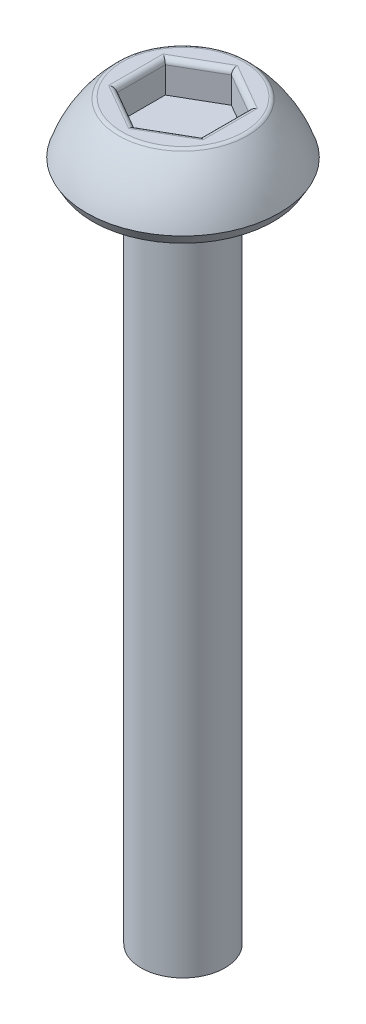
ISO-10303-21;
HEADER;
FILE_DESCRIPTION(('STEP AP214'),'2;1');
FILE_NAME('part.step','',(''),(''),'','','');
FILE_SCHEMA(('AUTOMOTIVE_DESIGN { 1 0 10303 214 1 1 1 1 }'));
ENDSEC;
DATA;
#1=APPLICATION_CONTEXT('core data for automotive mechanical design processes');
#2=APPLICATION_PROTOCOL_DEFINITION('international standard','automotive_design',2000,#1);
#3=PRODUCT_CONTEXT('',#1,'mechanical');
#4=PRODUCT('Part','Part','',(#3));
#5=PRODUCT_RELATED_PRODUCT_CATEGORY('part','',(#4));
#6=PRODUCT_DEFINITION_FORMATION('','',#4);
#7=PRODUCT_DEFINITION_CONTEXT('part definition',#1,'design');
#8=PRODUCT_DEFINITION('design','',#6,#7);
#9=PRODUCT_DEFINITION_SHAPE('','',#8);
#10=(LENGTH_UNIT() NAMED_UNIT(*) SI_UNIT(.MILLI.,.METRE.));
#11=(NAMED_UNIT(*) PLANE_ANGLE_UNIT() SI_UNIT($,.RADIAN.));
#12=(NAMED_UNIT(*) SI_UNIT($,.STERADIAN.) SOLID_ANGLE_UNIT());
#13=UNCERTAINTY_MEASURE_WITH_UNIT(LENGTH_MEASURE(1.E-05),#10,'distance_accuracy_value','');
#14=(GEOMETRIC_REPRESENTATION_CONTEXT(3) GLOBAL_UNCERTAINTY_ASSIGNED_CONTEXT((#13)) GLOBAL_UNIT_ASSIGNED_CONTEXT((#10,
#11,#12)) REPRESENTATION_CONTEXT('',''));
#15=CARTESIAN_POINT('',(0.,0.,0.));
#16=DIRECTION('',(0.,0.,1.));
#17=DIRECTION('',(1.,0.,0.));
#18=AXIS2_PLACEMENT_3D('',#15,#16,#17);
#19=CARTESIAN_POINT('',(0.,1.5,0.));
#20=DIRECTION('',(0.,-1.,0.));
#21=DIRECTION('',(0.,0.,-1.));
#22=AXIS2_PLACEMENT_3D('',#19,#20,#21);
#23=PLANE('',#22);
#24=CARTESIAN_POINT('',(0.,1.5,0.));
#25=DIRECTION('',(0.,-1.,0.));
#26=DIRECTION('',(0.,0.,-1.));
#27=AXIS2_PLACEMENT_3D('',#24,#25,#26);
#28=CIRCLE('',#27,1.45007695941143);
#29=CARTESIAN_POINT('',(0.,1.5,-1.45007695941143));
#30=VERTEX_POINT('',#29);
#31=EDGE_CURVE('E178',#30,#30,#28,.F.);
#32=ORIENTED_EDGE('',*,*,#31,.T.);
#33=EDGE_LOOP('',(#32));
#34=FACE_BOUND('',#33,.T.);
#35=DIRECTION('',(0.866025403784439,0.,-0.5));
#36=VECTOR('',#35,1.);
#37=CARTESIAN_POINT('',(0.5625,1.5,0.974278579257493));
#38=LINE('',#37,#36);
#39=CARTESIAN_POINT('',(1.125,1.5,0.649519052838329));
#40=VERTEX_POINT('',#39);
#41=CARTESIAN_POINT('',(0.,1.5,1.29903810567666));
#42=VERTEX_POINT('',#41);
#43=EDGE_CURVE('E173',#40,#42,#38,.F.);
#44=ORIENTED_EDGE('',*,*,#43,.T.);
#45=DIRECTION('',(0.866025403784439,0.,0.5));
#46=VECTOR('',#45,1.);
#47=CARTESIAN_POINT('',(-0.5625,1.5,0.974278579257493));
#48=LINE('',#47,#46);
#49=CARTESIAN_POINT('',(-1.125,1.5,0.649519052838329));
#50=VERTEX_POINT('',#49);
#51=EDGE_CURVE('E175',#42,#50,#48,.F.);
#52=ORIENTED_EDGE('',*,*,#51,.T.);
#53=DIRECTION('',(0.,0.,1.));
#54=VECTOR('',#53,1.);
#55=CARTESIAN_POINT('',(-1.125,1.5,0.));
#56=LINE('',#55,#54);
#57=CARTESIAN_POINT('',(-1.125,1.5,-0.649519052838329));
#58=VERTEX_POINT('',#57);
#59=EDGE_CURVE('E165',#50,#58,#56,.F.);
#60=ORIENTED_EDGE('',*,*,#59,.T.);
#61=DIRECTION('',(-0.866025403784439,0.,0.5));
#62=VECTOR('',#61,1.);
#63=CARTESIAN_POINT('',(-0.5625,1.5,-0.974278579257493));
#64=LINE('',#63,#62);
#65=CARTESIAN_POINT('',(0.,1.5,-1.29903810567666));
#66=VERTEX_POINT('',#65);
#67=EDGE_CURVE('E167',#58,#66,#64,.F.);
#68=ORIENTED_EDGE('',*,*,#67,.T.);
#69=DIRECTION('',(-0.866025403784439,0.,-0.5));
#70=VECTOR('',#69,1.);
#71=CARTESIAN_POINT('',(0.5625,1.5,-0.974278579257494));
#72=LINE('',#71,#70);
#73=CARTESIAN_POINT('',(1.125,1.5,-0.64951905283833));
#74=VERTEX_POINT('',#73);
#75=EDGE_CURVE('E169',#66,#74,#72,.F.);
#76=ORIENTED_EDGE('',*,*,#75,.T.);
#77=DIRECTION('',(0.,0.,-1.));
#78=VECTOR('',#77,1.);
#79=CARTESIAN_POINT('',(1.125,1.5,0.));
#80=LINE('',#79,#78);
#81=EDGE_CURVE('E171',#74,#40,#80,.F.);
#82=ORIENTED_EDGE('',*,*,#81,.T.);
#83=EDGE_LOOP('',(#44,#52,#60,#68,#76,#82));
#84=FACE_BOUND('',#83,.T.);
#85=ADVANCED_FACE('F36',(#34,#84),#23,.F.);
#86=CARTESIAN_POINT('',(0.,-0.691910970237067,0.));
#87=DIRECTION('',(0.,-1.,0.));
#88=DIRECTION('',(0.,0.,-1.));
#89=AXIS2_PLACEMENT_3D('',#86,#87,#88);
#90=DEGENERATE_TOROIDAL_SURFACE('',#89,0.548298390995416,3.,.F.);
#91=CARTESIAN_POINT('',(0.,1.46486569435813,0.));
#92=DIRECTION('',(0.,-1.,0.));
#93=DIRECTION('',(0.,0.,-1.));
#94=AXIS2_PLACEMENT_3D('',#91,#92,#93);
#95=CIRCLE('',#94,1.53696284421173);
#96=CARTESIAN_POINT('',(0.,1.46486569435813,-1.53696284421173));
#97=VERTEX_POINT('',#96);
#98=EDGE_CURVE('E162',#97,#97,#95,.T.);
#99=ORIENTED_EDGE('',*,*,#98,.T.);
#100=EDGE_LOOP('',(#99));
#101=FACE_BOUND('',#100,.T.);
#102=CARTESIAN_POINT('',(0.,0.25,0.));
#103=DIRECTION('',(0.,-1.,0.));
#104=DIRECTION('',(0.,0.,-1.));
#105=AXIS2_PLACEMENT_3D('',#102,#103,#104);
#106=CIRCLE('',#105,2.3);
#107=CARTESIAN_POINT('',(0.,0.25,-2.3));
#108=VERTEX_POINT('',#107);
#109=EDGE_CURVE('E159',#108,#108,#106,.T.);
#110=ORIENTED_EDGE('',*,*,#109,.F.);
#111=EDGE_LOOP('',(#110));
#112=FACE_BOUND('',#111,.T.);
#113=ADVANCED_FACE('F245',(#101,#112),#90,.F.);
#114=CARTESIAN_POINT('',(0.,0.25,0.));
#115=DIRECTION('',(0.,1.,0.));
#116=DIRECTION('',(0.,0.,1.));
#117=AXIS2_PLACEMENT_3D('',#114,#115,#116);
#118=CONICAL_SURFACE('',#117,2.3,0.523598775598296);
#119=CARTESIAN_POINT('',(0.,0.,0.));
#120=DIRECTION('',(0.,-1.,0.));
#121=DIRECTION('',(0.,0.,-1.));
#122=AXIS2_PLACEMENT_3D('',#119,#120,#121);
#123=CIRCLE('',#122,2.15566243270259);
#124=CARTESIAN_POINT('',(0.,0.,-2.15566243270259));
#125=VERTEX_POINT('',#124);
#126=EDGE_CURVE('E156',#125,#125,#123,.T.);
#127=ORIENTED_EDGE('',*,*,#126,.F.);
#128=EDGE_LOOP('',(#127));
#129=FACE_BOUND('',#128,.T.);
#130=ORIENTED_EDGE('',*,*,#109,.T.);
#131=EDGE_LOOP('',(#130));
#132=FACE_BOUND('',#131,.T.);
#133=ADVANCED_FACE('F251',(#129,#132),#118,.T.);
#134=CARTESIAN_POINT('',(0.,0.,2.15566243270259));
#135=DIRECTION('',(0.,1.,0.));
#136=DIRECTION('',(0.,0.,1.));
#137=AXIS2_PLACEMENT_3D('',#134,#135,#136);
#138=PLANE('',#137);
#139=CARTESIAN_POINT('',(0.,0.,0.));
#140=DIRECTION('',(0.,-1.,0.));
#141=DIRECTION('',(0.,0.,-1.));
#142=AXIS2_PLACEMENT_3D('',#139,#140,#141);
#143=CIRCLE('',#142,1.);
#144=CARTESIAN_POINT('',(0.,0.,-1.));
#145=VERTEX_POINT('',#144);
#146=EDGE_CURVE('E153',#145,#145,#143,.T.);
#147=ORIENTED_EDGE('',*,*,#146,.F.);
#148=EDGE_LOOP('',(#147));
#149=FACE_BOUND('',#148,.T.);
#150=ORIENTED_EDGE('',*,*,#126,.T.);
#151=EDGE_LOOP('',(#150));
#152=FACE_BOUND('',#151,.T.);
#153=ADVANCED_FACE('F270',(#149,#152),#138,.F.);
#154=CARTESIAN_POINT('',(0.,-16.,0.));
#155=DIRECTION('',(0.,-1.,0.));
#156=DIRECTION('',(0.,0.,-1.));
#157=AXIS2_PLACEMENT_3D('',#154,#155,#156);
#158=CYLINDRICAL_SURFACE('',#157,0.999999999999999);
#159=CARTESIAN_POINT('',(0.,-16.,0.));
#160=DIRECTION('',(0.,-1.,0.));
#161=DIRECTION('',(0.,0.,-1.));
#162=AXIS2_PLACEMENT_3D('',#159,#160,#161);
#163=CIRCLE('',#162,0.999999999999998);
#164=CARTESIAN_POINT('',(0.,-16.,-0.999999999999998));
#165=VERTEX_POINT('',#164);
#166=EDGE_CURVE('E140',#165,#165,#163,.T.);
#167=ORIENTED_EDGE('',*,*,#166,.F.);
#168=EDGE_LOOP('',(#167));
#169=FACE_BOUND('',#168,.T.);
#170=ORIENTED_EDGE('',*,*,#146,.T.);
#171=EDGE_LOOP('',(#170));
#172=FACE_BOUND('',#171,.T.);
#173=ADVANCED_FACE('F275',(#169,#172),#158,.T.);
#174=CARTESIAN_POINT('',(0.,-16.,0.999999999999998));
#175=DIRECTION('',(0.,1.,0.));
#176=DIRECTION('',(0.,0.,1.));
#177=AXIS2_PLACEMENT_3D('',#174,#175,#176);
#178=PLANE('',#177);
#179=ORIENTED_EDGE('',*,*,#166,.T.);
#180=EDGE_LOOP('',(#179));
#181=FACE_BOUND('',#180,.T.);
#182=ADVANCED_FACE('F282',(#181),#178,.F.);
#183=CARTESIAN_POINT('',(0.999999999999999,0.75,-0.577350269189626));
#184=DIRECTION('',(0.5,0.,-0.866025403784439));
#185=DIRECTION('',(-0.866025403784439,0.,-0.5));
#186=AXIS2_PLACEMENT_3D('',#183,#184,#185);
#187=PLANE('',#186);
#188=DIRECTION('',(0.,1.,0.));
#189=VECTOR('',#188,1.);
#190=CARTESIAN_POINT('',(0.999999999999999,0.75,-0.577350269189626));
#191=LINE('',#190,#189);
#192=CARTESIAN_POINT('',(0.999999999999999,0.75,-0.577350269189626));
#193=VERTEX_POINT('',#192);
#194=CARTESIAN_POINT('',(0.999999999999999,1.375,-0.577350269189626));
#195=VERTEX_POINT('',#194);
#196=EDGE_CURVE('E138',#193,#195,#191,.T.);
#197=ORIENTED_EDGE('',*,*,#196,.T.);
#198=DIRECTION('',(-0.866025403784439,0.,-0.5));
#199=VECTOR('',#198,1.);
#200=CARTESIAN_POINT('',(0.999999999999999,1.375,-0.577350269189626));
#201=LINE('',#200,#199);
#202=CARTESIAN_POINT('',(0.,1.375,-1.15470053837925));
#203=VERTEX_POINT('',#202);
#204=EDGE_CURVE('E60',#195,#203,#201,.T.);
#205=ORIENTED_EDGE('',*,*,#204,.T.);
#206=DIRECTION('',(0.,1.,0.));
#207=VECTOR('',#206,1.);
#208=CARTESIAN_POINT('',(0.,0.75,-1.15470053837925));
#209=LINE('',#208,#207);
#210=CARTESIAN_POINT('',(0.,0.75,-1.15470053837925));
#211=VERTEX_POINT('',#210);
#212=EDGE_CURVE('E106',#211,#203,#209,.T.);
#213=ORIENTED_EDGE('',*,*,#212,.F.);
#214=DIRECTION('',(-0.866025403784439,0.,-0.5));
#215=VECTOR('',#214,1.);
#216=CARTESIAN_POINT('',(0.999999999999999,0.75,-0.577350269189626));
#217=LINE('',#216,#215);
#218=EDGE_CURVE('E110',#193,#211,#217,.T.);
#219=ORIENTED_EDGE('',*,*,#218,.F.);
#220=EDGE_LOOP('',(#197,#205,#213,#219));
#221=FACE_BOUND('',#220,.T.);
#222=ADVANCED_FACE('F108',(#221),#187,.F.);
#223=CARTESIAN_POINT('',(1.,0.75,0.577350269189626));
#224=DIRECTION('',(1.,0.,0.));
#225=DIRECTION('',(0.,0.,-1.));
#226=AXIS2_PLACEMENT_3D('',#223,#224,#225);
#227=PLANE('',#226);
#228=DIRECTION('',(0.,1.,0.));
#229=VECTOR('',#228,1.);
#230=CARTESIAN_POINT('',(1.,0.75,0.577350269189626));
#231=LINE('',#230,#229);
#232=CARTESIAN_POINT('',(1.,0.75,0.577350269189626));
#233=VERTEX_POINT('',#232);
#234=CARTESIAN_POINT('',(1.,1.375,0.577350269189626));
#235=VERTEX_POINT('',#234);
#236=EDGE_CURVE('E141',#233,#235,#231,.T.);
#237=ORIENTED_EDGE('',*,*,#236,.T.);
#238=DIRECTION('',(0.,0.,-1.));
#239=VECTOR('',#238,1.);
#240=CARTESIAN_POINT('',(1.,1.375,0.577350269189626));
#241=LINE('',#240,#239);
#242=EDGE_CURVE('E186',#235,#195,#241,.T.);
#243=ORIENTED_EDGE('',*,*,#242,.T.);
#244=ORIENTED_EDGE('',*,*,#196,.F.);
#245=DIRECTION('',(0.,0.,-1.));
#246=VECTOR('',#245,1.);
#247=CARTESIAN_POINT('',(1.,0.75,0.577350269189626));
#248=LINE('',#247,#246);
#249=EDGE_CURVE('E114',#233,#193,#248,.T.);
#250=ORIENTED_EDGE('',*,*,#249,.F.);
#251=EDGE_LOOP('',(#237,#243,#244,#250));
#252=FACE_BOUND('',#251,.T.);
#253=ADVANCED_FACE('F226',(#252),#227,.F.);
#254=CARTESIAN_POINT('',(0.,0.75,1.15470053837925));
#255=DIRECTION('',(0.5,0.,0.866025403784439));
#256=DIRECTION('',(0.866025403784439,0.,-0.5));
#257=AXIS2_PLACEMENT_3D('',#254,#255,#256);
#258=PLANE('',#257);
#259=DIRECTION('',(0.,1.,0.));
#260=VECTOR('',#259,1.);
#261=CARTESIAN_POINT('',(0.,0.75,1.15470053837925));
#262=LINE('',#261,#260);
#263=CARTESIAN_POINT('',(0.,0.75,1.15470053837925));
#264=VERTEX_POINT('',#263);
#265=CARTESIAN_POINT('',(0.,1.375,1.15470053837925));
#266=VERTEX_POINT('',#265);
#267=EDGE_CURVE('E144',#264,#266,#262,.T.);
#268=ORIENTED_EDGE('',*,*,#267,.T.);
#269=DIRECTION('',(0.866025403784439,0.,-0.5));
#270=VECTOR('',#269,1.);
#271=CARTESIAN_POINT('',(0.,1.375,1.15470053837925));
#272=LINE('',#271,#270);
#273=EDGE_CURVE('E184',#266,#235,#272,.T.);
#274=ORIENTED_EDGE('',*,*,#273,.T.);
#275=ORIENTED_EDGE('',*,*,#236,.F.);
#276=DIRECTION('',(0.866025403784439,0.,-0.5));
#277=VECTOR('',#276,1.);
#278=CARTESIAN_POINT('',(0.,0.75,1.15470053837925));
#279=LINE('',#278,#277);
#280=EDGE_CURVE('E135',#264,#233,#279,.T.);
#281=ORIENTED_EDGE('',*,*,#280,.F.);
#282=EDGE_LOOP('',(#268,#274,#275,#281));
#283=FACE_BOUND('',#282,.T.);
#284=ADVANCED_FACE('F227',(#283),#258,.F.);
#285=CARTESIAN_POINT('',(-0.999999999999999,0.75,0.577350269189626));
#286=DIRECTION('',(-0.5,0.,0.866025403784439));
#287=DIRECTION('',(0.866025403784439,0.,0.5));
#288=AXIS2_PLACEMENT_3D('',#285,#286,#287);
#289=PLANE('',#288);
#290=DIRECTION('',(0.,1.,0.));
#291=VECTOR('',#290,1.);
#292=CARTESIAN_POINT('',(-0.999999999999999,0.75,0.577350269189626));
#293=LINE('',#292,#291);
#294=CARTESIAN_POINT('',(-0.999999999999999,0.75,0.577350269189626));
#295=VERTEX_POINT('',#294);
#296=CARTESIAN_POINT('',(-0.999999999999999,1.375,0.577350269189626));
#297=VERTEX_POINT('',#296);
#298=EDGE_CURVE('E147',#295,#297,#293,.T.);
#299=ORIENTED_EDGE('',*,*,#298,.T.);
#300=DIRECTION('',(0.866025403784439,0.,0.5));
#301=VECTOR('',#300,1.);
#302=CARTESIAN_POINT('',(-0.999999999999999,1.375,0.577350269189626));
#303=LINE('',#302,#301);
#304=EDGE_CURVE('E181',#297,#266,#303,.T.);
#305=ORIENTED_EDGE('',*,*,#304,.T.);
#306=ORIENTED_EDGE('',*,*,#267,.F.);
#307=DIRECTION('',(0.866025403784439,0.,0.5));
#308=VECTOR('',#307,1.);
#309=CARTESIAN_POINT('',(-0.999999999999999,0.75,0.577350269189626));
#310=LINE('',#309,#308);
#311=EDGE_CURVE('E132',#295,#264,#310,.T.);
#312=ORIENTED_EDGE('',*,*,#311,.F.);
#313=EDGE_LOOP('',(#299,#305,#306,#312));
#314=FACE_BOUND('',#313,.T.);
#315=ADVANCED_FACE('F222',(#314),#289,.F.);
#316=CARTESIAN_POINT('',(-1.,0.75,-0.577350269189626));
#317=DIRECTION('',(-1.,0.,0.));
#318=DIRECTION('',(0.,0.,1.));
#319=AXIS2_PLACEMENT_3D('',#316,#317,#318);
#320=PLANE('',#319);
#321=DIRECTION('',(0.,1.,0.));
#322=VECTOR('',#321,1.);
#323=CARTESIAN_POINT('',(-1.,0.75,-0.577350269189626));
#324=LINE('',#323,#322);
#325=CARTESIAN_POINT('',(-1.,0.75,-0.577350269189626));
#326=VERTEX_POINT('',#325);
#327=CARTESIAN_POINT('',(-1.,1.375,-0.577350269189626));
#328=VERTEX_POINT('',#327);
#329=EDGE_CURVE('E113',#326,#328,#324,.T.);
#330=ORIENTED_EDGE('',*,*,#329,.T.);
#331=DIRECTION('',(0.,0.,1.));
#332=VECTOR('',#331,1.);
#333=CARTESIAN_POINT('',(-1.,1.375,-0.577350269189626));
#334=LINE('',#333,#332);
#335=EDGE_CURVE('E11',#328,#297,#334,.T.);
#336=ORIENTED_EDGE('',*,*,#335,.T.);
#337=ORIENTED_EDGE('',*,*,#298,.F.);
#338=DIRECTION('',(0.,0.,1.));
#339=VECTOR('',#338,1.);
#340=CARTESIAN_POINT('',(-1.,0.75,-0.577350269189626));
#341=LINE('',#340,#339);
#342=EDGE_CURVE('E122',#326,#295,#341,.T.);
#343=ORIENTED_EDGE('',*,*,#342,.F.);
#344=EDGE_LOOP('',(#330,#336,#337,#343));
#345=FACE_BOUND('',#344,.T.);
#346=ADVANCED_FACE('F219',(#345),#320,.F.);
#347=CARTESIAN_POINT('',(0.,0.75,-1.15470053837925));
#348=DIRECTION('',(-0.5,0.,-0.866025403784438));
#349=DIRECTION('',(-0.866025403784439,0.,0.5));
#350=AXIS2_PLACEMENT_3D('',#347,#348,#349);
#351=PLANE('',#350);
#352=ORIENTED_EDGE('',*,*,#212,.T.);
#353=DIRECTION('',(-0.866025403784439,0.,0.5));
#354=VECTOR('',#353,1.);
#355=CARTESIAN_POINT('',(0.,1.375,-1.15470053837925));
#356=LINE('',#355,#354);
#357=EDGE_CURVE('E45',#203,#328,#356,.T.);
#358=ORIENTED_EDGE('',*,*,#357,.T.);
#359=ORIENTED_EDGE('',*,*,#329,.F.);
#360=DIRECTION('',(-0.866025403784439,0.,0.5));
#361=VECTOR('',#360,1.);
#362=CARTESIAN_POINT('',(0.,0.75,-1.15470053837925));
#363=LINE('',#362,#361);
#364=EDGE_CURVE('E117',#211,#326,#363,.T.);
#365=ORIENTED_EDGE('',*,*,#364,.F.);
#366=EDGE_LOOP('',(#352,#358,#359,#365));
#367=FACE_BOUND('',#366,.T.);
#368=ADVANCED_FACE('F118',(#367),#351,.F.);
#369=CARTESIAN_POINT('',(0.,0.75,0.));
#370=DIRECTION('',(0.,1.,0.));
#371=DIRECTION('',(0.,0.,1.));
#372=AXIS2_PLACEMENT_3D('',#369,#370,#371);
#373=PLANE('',#372);
#374=ORIENTED_EDGE('',*,*,#218,.T.);
#375=ORIENTED_EDGE('',*,*,#364,.T.);
#376=ORIENTED_EDGE('',*,*,#342,.T.);
#377=ORIENTED_EDGE('',*,*,#311,.T.);
#378=ORIENTED_EDGE('',*,*,#280,.T.);
#379=ORIENTED_EDGE('',*,*,#249,.T.);
#380=EDGE_LOOP('',(#374,#375,#376,#377,#378,#379));
#381=FACE_BOUND('',#380,.T.);
#382=ADVANCED_FACE('F124',(#381),#373,.T.);
#383=CARTESIAN_POINT('',(0.,1.375,0.));
#384=DIRECTION('',(0.,-1.,0.));
#385=DIRECTION('',(0.,0.,-1.));
#386=AXIS2_PLACEMENT_3D('',#383,#384,#385);
#387=TOROIDAL_SURFACE('',#386,1.45007695941143,0.125);
#388=ORIENTED_EDGE('',*,*,#31,.F.);
#389=EDGE_LOOP('',(#388));
#390=FACE_BOUND('',#389,.T.);
#391=ORIENTED_EDGE('',*,*,#98,.F.);
#392=EDGE_LOOP('',(#391));
#393=FACE_BOUND('',#392,.T.);
#394=ADVANCED_FACE('F255',(#390,#393),#387,.T.);
#395=CARTESIAN_POINT('',(1.0625,1.375,-0.685603444662681));
#396=DIRECTION('',(-0.866025403784439,0.,-0.5));
#397=DIRECTION('',(-0.5,0.,0.866025403784439));
#398=AXIS2_PLACEMENT_3D('',#395,#396,#397);
#399=CYLINDRICAL_SURFACE('',#398,0.125);
#400=CARTESIAN_POINT('',(1.125,1.375,-0.64951905283833));
#401=DIRECTION('',(-0.5,0.,-0.866025403784438));
#402=DIRECTION('',(0.866025403784439,0.,-0.5));
#403=AXIS2_PLACEMENT_3D('',#400,#401,#402);
#404=ELLIPSE('',#403,0.144337567297406,0.125);
#405=EDGE_CURVE('E129',#74,#195,#404,.F.);
#406=ORIENTED_EDGE('',*,*,#405,.F.);
#407=ORIENTED_EDGE('',*,*,#75,.F.);
#408=CARTESIAN_POINT('',(0.,1.375,-1.29903810567666));
#409=DIRECTION('',(-1.,0.,0.));
#410=DIRECTION('',(0.,0.,-1.));
#411=AXIS2_PLACEMENT_3D('',#408,#409,#410);
#412=ELLIPSE('',#411,0.144337567297406,0.125);
#413=EDGE_CURVE('E40',#203,#66,#412,.T.);
#414=ORIENTED_EDGE('',*,*,#413,.F.);
#415=ORIENTED_EDGE('',*,*,#204,.F.);
#416=EDGE_LOOP('',(#406,#407,#414,#415));
#417=FACE_BOUND('',#416,.T.);
#418=ADVANCED_FACE('F38',(#417),#399,.T.);
#419=CARTESIAN_POINT('',(-0.0625000000000002,1.375,-1.26295371385231));
#420=DIRECTION('',(-0.866025403784439,0.,0.5));
#421=DIRECTION('',(0.5,0.,0.866025403784439));
#422=AXIS2_PLACEMENT_3D('',#419,#420,#421);
#423=CYLINDRICAL_SURFACE('',#422,0.125);
#424=ORIENTED_EDGE('',*,*,#413,.T.);
#425=ORIENTED_EDGE('',*,*,#67,.F.);
#426=CARTESIAN_POINT('',(-1.125,1.375,-0.649519052838329));
#427=DIRECTION('',(-0.5,0.,0.866025403784439));
#428=DIRECTION('',(-0.866025403784439,0.,-0.5));
#429=AXIS2_PLACEMENT_3D('',#426,#427,#428);
#430=ELLIPSE('',#429,0.144337567297406,0.125);
#431=EDGE_CURVE('E197',#328,#58,#430,.T.);
#432=ORIENTED_EDGE('',*,*,#431,.F.);
#433=ORIENTED_EDGE('',*,*,#357,.F.);
#434=EDGE_LOOP('',(#424,#425,#432,#433));
#435=FACE_BOUND('',#434,.T.);
#436=ADVANCED_FACE('F211',(#435),#423,.T.);
#437=CARTESIAN_POINT('',(1.125,1.375,0.577350269189626));
#438=DIRECTION('',(0.,0.,-1.));
#439=DIRECTION('',(-1.,0.,0.));
#440=AXIS2_PLACEMENT_3D('',#437,#438,#439);
#441=CYLINDRICAL_SURFACE('',#440,0.125);
#442=ORIENTED_EDGE('',*,*,#405,.T.);
#443=ORIENTED_EDGE('',*,*,#242,.F.);
#444=CARTESIAN_POINT('',(1.125,1.375,0.649519052838329));
#445=DIRECTION('',(0.5,0.,-0.866025403784439));
#446=DIRECTION('',(0.866025403784439,0.,0.5));
#447=AXIS2_PLACEMENT_3D('',#444,#445,#446);
#448=ELLIPSE('',#447,0.144337567297406,0.125);
#449=EDGE_CURVE('E194',#40,#235,#448,.F.);
#450=ORIENTED_EDGE('',*,*,#449,.F.);
#451=ORIENTED_EDGE('',*,*,#81,.F.);
#452=EDGE_LOOP('',(#442,#443,#450,#451));
#453=FACE_BOUND('',#452,.T.);
#454=ADVANCED_FACE('F204',(#453),#441,.T.);
#455=CARTESIAN_POINT('',(-1.125,1.375,-0.577350269189626));
#456=DIRECTION('',(0.,0.,1.));
#457=DIRECTION('',(1.,0.,0.));
#458=AXIS2_PLACEMENT_3D('',#455,#456,#457);
#459=CYLINDRICAL_SURFACE('',#458,0.125);
#460=ORIENTED_EDGE('',*,*,#431,.T.);
#461=ORIENTED_EDGE('',*,*,#59,.F.);
#462=CARTESIAN_POINT('',(-1.125,1.375,0.649519052838329));
#463=DIRECTION('',(0.5,0.,0.866025403784438));
#464=DIRECTION('',(0.866025403784439,0.,-0.5));
#465=AXIS2_PLACEMENT_3D('',#462,#463,#464);
#466=ELLIPSE('',#465,0.144337567297406,0.125);
#467=EDGE_CURVE('E192',#297,#50,#466,.T.);
#468=ORIENTED_EDGE('',*,*,#467,.F.);
#469=ORIENTED_EDGE('',*,*,#335,.F.);
#470=EDGE_LOOP('',(#460,#461,#468,#469));
#471=FACE_BOUND('',#470,.T.);
#472=ADVANCED_FACE('F216',(#471),#459,.T.);
#473=CARTESIAN_POINT('',(0.0625000000000004,1.375,1.26295371385231));
#474=DIRECTION('',(0.866025403784439,0.,-0.5));
#475=DIRECTION('',(-0.5,0.,-0.866025403784439));
#476=AXIS2_PLACEMENT_3D('',#473,#474,#475);
#477=CYLINDRICAL_SURFACE('',#476,0.125);
#478=ORIENTED_EDGE('',*,*,#449,.T.);
#479=ORIENTED_EDGE('',*,*,#273,.F.);
#480=CARTESIAN_POINT('',(0.,1.375,1.29903810567666));
#481=DIRECTION('',(1.,0.,0.));
#482=DIRECTION('',(0.,0.,1.));
#483=AXIS2_PLACEMENT_3D('',#480,#481,#482);
#484=ELLIPSE('',#483,0.144337567297406,0.125);
#485=EDGE_CURVE('E190',#42,#266,#484,.F.);
#486=ORIENTED_EDGE('',*,*,#485,.F.);
#487=ORIENTED_EDGE('',*,*,#43,.F.);
#488=EDGE_LOOP('',(#478,#479,#486,#487));
#489=FACE_BOUND('',#488,.T.);
#490=ADVANCED_FACE('F231',(#489),#477,.T.);
#491=CARTESIAN_POINT('',(-1.0625,1.375,0.685603444662681));
#492=DIRECTION('',(0.866025403784439,0.,0.5));
#493=DIRECTION('',(0.5,0.,-0.866025403784439));
#494=AXIS2_PLACEMENT_3D('',#491,#492,#493);
#495=CYLINDRICAL_SURFACE('',#494,0.125);
#496=ORIENTED_EDGE('',*,*,#467,.T.);
#497=ORIENTED_EDGE('',*,*,#51,.F.);
#498=ORIENTED_EDGE('',*,*,#485,.T.);
#499=ORIENTED_EDGE('',*,*,#304,.F.);
#500=EDGE_LOOP('',(#496,#497,#498,#499));
#501=FACE_BOUND('',#500,.T.);
#502=ADVANCED_FACE('F236',(#501),#495,.T.);
#503=CLOSED_SHELL('',(#85,#113,#133,#153,#173,#182,#222,#253,#284,#315,#346,#368,#382,#394,#418,
#436,#454,#472,#490,#502));
#504=MANIFOLD_SOLID_BREP('B2',#503);
#505=ADVANCED_BREP_SHAPE_REPRESENTATION('',(#18,#504),#14);
#506=SHAPE_DEFINITION_REPRESENTATION(#9,#505);
ENDSEC;
END-ISO-10303-21;
